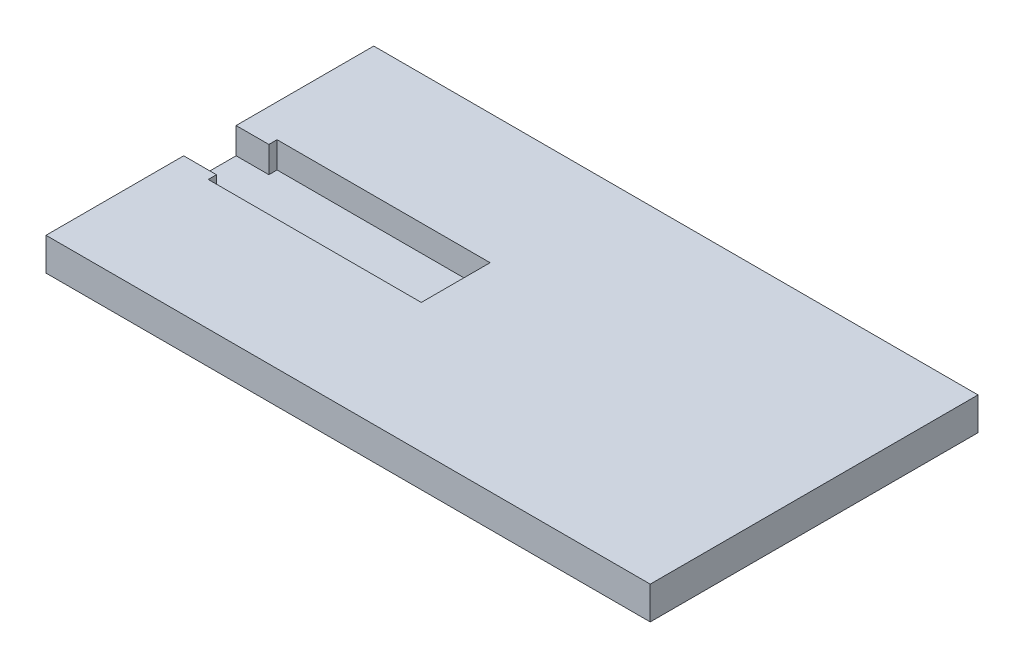
ISO-10303-21;
HEADER;
FILE_DESCRIPTION(('STEP AP214'),'2;1');
FILE_NAME('part.step','',(''),(''),'','','');
FILE_SCHEMA(('AUTOMOTIVE_DESIGN { 1 0 10303 214 1 1 1 1 }'));
ENDSEC;
DATA;
#1=APPLICATION_CONTEXT('core data for automotive mechanical design processes');
#2=APPLICATION_PROTOCOL_DEFINITION('international standard','automotive_design',2000,#1);
#3=PRODUCT_CONTEXT('',#1,'mechanical');
#4=PRODUCT('Part','Part','',(#3));
#5=PRODUCT_RELATED_PRODUCT_CATEGORY('part','',(#4));
#6=PRODUCT_DEFINITION_FORMATION('','',#4);
#7=PRODUCT_DEFINITION_CONTEXT('part definition',#1,'design');
#8=PRODUCT_DEFINITION('design','',#6,#7);
#9=PRODUCT_DEFINITION_SHAPE('','',#8);
#10=(LENGTH_UNIT() NAMED_UNIT(*) SI_UNIT(.MILLI.,.METRE.));
#11=(NAMED_UNIT(*) PLANE_ANGLE_UNIT() SI_UNIT($,.RADIAN.));
#12=(NAMED_UNIT(*) SI_UNIT($,.STERADIAN.) SOLID_ANGLE_UNIT());
#13=UNCERTAINTY_MEASURE_WITH_UNIT(LENGTH_MEASURE(1.E-05),#10,'distance_accuracy_value','');
#14=(GEOMETRIC_REPRESENTATION_CONTEXT(3) GLOBAL_UNCERTAINTY_ASSIGNED_CONTEXT((#13)) GLOBAL_UNIT_ASSIGNED_CONTEXT((#10,
#11,#12)) REPRESENTATION_CONTEXT('',''));
#15=CARTESIAN_POINT('',(0.,0.,0.));
#16=DIRECTION('',(0.,0.,1.));
#17=DIRECTION('',(1.,0.,0.));
#18=AXIS2_PLACEMENT_3D('',#15,#16,#17);
#19=CARTESIAN_POINT('',(46.09,5.,25.));
#20=DIRECTION('',(-1.,0.,0.));
#21=DIRECTION('',(0.,0.,1.));
#22=AXIS2_PLACEMENT_3D('',#19,#20,#21);
#23=PLANE('',#22);
#24=DIRECTION('',(0.,0.,-1.));
#25=VECTOR('',#24,1.);
#26=CARTESIAN_POINT('',(46.09,0.,25.));
#27=LINE('',#26,#25);
#28=CARTESIAN_POINT('',(46.09,0.,25.));
#29=VERTEX_POINT('',#28);
#30=CARTESIAN_POINT('',(46.09,0.,-25.));
#31=VERTEX_POINT('',#30);
#32=EDGE_CURVE('E185',#29,#31,#27,.T.);
#33=ORIENTED_EDGE('',*,*,#32,.T.);
#34=DIRECTION('',(0.,-1.,0.));
#35=VECTOR('',#34,1.);
#36=CARTESIAN_POINT('',(46.09,5.,-25.));
#37=LINE('',#36,#35);
#38=CARTESIAN_POINT('',(46.09,5.,-25.));
#39=VERTEX_POINT('',#38);
#40=EDGE_CURVE('E11',#39,#31,#37,.T.);
#41=ORIENTED_EDGE('',*,*,#40,.F.);
#42=DIRECTION('',(0.,0.,-1.));
#43=VECTOR('',#42,1.);
#44=CARTESIAN_POINT('',(46.09,5.,25.));
#45=LINE('',#44,#43);
#46=CARTESIAN_POINT('',(46.09,5.,25.));
#47=VERTEX_POINT('',#46);
#48=EDGE_CURVE('E198',#47,#39,#45,.T.);
#49=ORIENTED_EDGE('',*,*,#48,.F.);
#50=DIRECTION('',(0.,-1.,0.));
#51=VECTOR('',#50,1.);
#52=CARTESIAN_POINT('',(46.09,5.,25.));
#53=LINE('',#52,#51);
#54=EDGE_CURVE('E206',#47,#29,#53,.T.);
#55=ORIENTED_EDGE('',*,*,#54,.T.);
#56=EDGE_LOOP('',(#33,#41,#49,#55));
#57=FACE_BOUND('',#56,.T.);
#58=ADVANCED_FACE('F33',(#57),#23,.F.);
#59=CARTESIAN_POINT('',(-46.09,5.,-25.));
#60=DIRECTION('',(0.,0.,1.));
#61=DIRECTION('',(1.,0.,0.));
#62=AXIS2_PLACEMENT_3D('',#59,#60,#61);
#63=PLANE('',#62);
#64=DIRECTION('',(-1.,0.,0.));
#65=VECTOR('',#64,1.);
#66=CARTESIAN_POINT('',(-46.09,0.,-25.));
#67=LINE('',#66,#65);
#68=CARTESIAN_POINT('',(-46.09,0.,-25.));
#69=VERTEX_POINT('',#68);
#70=EDGE_CURVE('E209',#31,#69,#67,.T.);
#71=ORIENTED_EDGE('',*,*,#70,.T.);
#72=DIRECTION('',(0.,-1.,0.));
#73=VECTOR('',#72,1.);
#74=CARTESIAN_POINT('',(-46.09,5.,-25.));
#75=LINE('',#74,#73);
#76=CARTESIAN_POINT('',(-46.09,5.,-25.));
#77=VERTEX_POINT('',#76);
#78=EDGE_CURVE('E40',#77,#69,#75,.T.);
#79=ORIENTED_EDGE('',*,*,#78,.F.);
#80=DIRECTION('',(-1.,0.,0.));
#81=VECTOR('',#80,1.);
#82=CARTESIAN_POINT('',(-46.09,5.,-25.));
#83=LINE('',#82,#81);
#84=EDGE_CURVE('E84',#39,#77,#83,.T.);
#85=ORIENTED_EDGE('',*,*,#84,.F.);
#86=ORIENTED_EDGE('',*,*,#40,.T.);
#87=EDGE_LOOP('',(#71,#79,#85,#86));
#88=FACE_BOUND('',#87,.T.);
#89=ADVANCED_FACE('F259',(#88),#63,.F.);
#90=CARTESIAN_POINT('',(-46.09,5.,25.));
#91=DIRECTION('',(1.,0.,0.));
#92=DIRECTION('',(0.,0.,-1.));
#93=AXIS2_PLACEMENT_3D('',#90,#91,#92);
#94=PLANE('',#93);
#95=DIRECTION('',(0.,0.,1.));
#96=VECTOR('',#95,1.);
#97=CARTESIAN_POINT('',(-46.09,5.,25.));
#98=LINE('',#97,#96);
#99=CARTESIAN_POINT('',(-46.09,5.,4.));
#100=VERTEX_POINT('',#99);
#101=CARTESIAN_POINT('',(-46.09,5.,25.));
#102=VERTEX_POINT('',#101);
#103=EDGE_CURVE('E201',#100,#102,#98,.T.);
#104=ORIENTED_EDGE('',*,*,#103,.F.);
#105=DIRECTION('',(0.,1.,0.));
#106=VECTOR('',#105,1.);
#107=CARTESIAN_POINT('',(-46.09,1.,4.));
#108=LINE('',#107,#106);
#109=CARTESIAN_POINT('',(-46.09,1.,4.));
#110=VERTEX_POINT('',#109);
#111=EDGE_CURVE('E190',#110,#100,#108,.T.);
#112=ORIENTED_EDGE('',*,*,#111,.F.);
#113=DIRECTION('',(0.,0.,1.));
#114=VECTOR('',#113,1.);
#115=CARTESIAN_POINT('',(-46.09,1.,4.));
#116=LINE('',#115,#114);
#117=CARTESIAN_POINT('',(-46.09,1.,-4.));
#118=VERTEX_POINT('',#117);
#119=EDGE_CURVE('E161',#118,#110,#116,.T.);
#120=ORIENTED_EDGE('',*,*,#119,.F.);
#121=DIRECTION('',(0.,1.,0.));
#122=VECTOR('',#121,1.);
#123=CARTESIAN_POINT('',(-46.09,1.,-4.));
#124=LINE('',#123,#122);
#125=CARTESIAN_POINT('',(-46.09,5.,-4.));
#126=VERTEX_POINT('',#125);
#127=EDGE_CURVE('E192',#118,#126,#124,.T.);
#128=ORIENTED_EDGE('',*,*,#127,.T.);
#129=EDGE_CURVE('E202',#77,#126,#98,.T.);
#130=ORIENTED_EDGE('',*,*,#129,.F.);
#131=ORIENTED_EDGE('',*,*,#78,.T.);
#132=DIRECTION('',(0.,0.,1.));
#133=VECTOR('',#132,1.);
#134=CARTESIAN_POINT('',(-46.09,0.,25.));
#135=LINE('',#134,#133);
#136=CARTESIAN_POINT('',(-46.09,0.,25.));
#137=VERTEX_POINT('',#136);
#138=EDGE_CURVE('E211',#69,#137,#135,.T.);
#139=ORIENTED_EDGE('',*,*,#138,.T.);
#140=DIRECTION('',(0.,-1.,0.));
#141=VECTOR('',#140,1.);
#142=CARTESIAN_POINT('',(-46.09,5.,25.));
#143=LINE('',#142,#141);
#144=EDGE_CURVE('E215',#102,#137,#143,.T.);
#145=ORIENTED_EDGE('',*,*,#144,.F.);
#146=EDGE_LOOP('',(#104,#112,#120,#128,#130,#131,#139,#145));
#147=FACE_BOUND('',#146,.T.);
#148=ADVANCED_FACE('F221',(#147),#94,.F.);
#149=CARTESIAN_POINT('',(-46.09,5.,25.));
#150=DIRECTION('',(0.,0.,-1.));
#151=DIRECTION('',(-1.,0.,0.));
#152=AXIS2_PLACEMENT_3D('',#149,#150,#151);
#153=PLANE('',#152);
#154=DIRECTION('',(1.,0.,0.));
#155=VECTOR('',#154,1.);
#156=CARTESIAN_POINT('',(-46.09,0.,25.));
#157=LINE('',#156,#155);
#158=EDGE_CURVE('E77',#137,#29,#157,.T.);
#159=ORIENTED_EDGE('',*,*,#158,.T.);
#160=ORIENTED_EDGE('',*,*,#54,.F.);
#161=DIRECTION('',(1.,0.,0.));
#162=VECTOR('',#161,1.);
#163=CARTESIAN_POINT('',(-46.09,5.,25.));
#164=LINE('',#163,#162);
#165=EDGE_CURVE('E56',#102,#47,#164,.T.);
#166=ORIENTED_EDGE('',*,*,#165,.F.);
#167=ORIENTED_EDGE('',*,*,#144,.T.);
#168=EDGE_LOOP('',(#159,#160,#166,#167));
#169=FACE_BOUND('',#168,.T.);
#170=ADVANCED_FACE('F229',(#169),#153,.F.);
#171=CARTESIAN_POINT('',(0.,5.,0.));
#172=DIRECTION('',(0.,-1.,0.));
#173=DIRECTION('',(0.,0.,-1.));
#174=AXIS2_PLACEMENT_3D('',#171,#172,#173);
#175=PLANE('',#174);
#176=DIRECTION('',(0.,0.,1.));
#177=VECTOR('',#176,1.);
#178=CARTESIAN_POINT('',(-41.09,5.,4.));
#179=LINE('',#178,#177);
#180=CARTESIAN_POINT('',(-41.09,5.,4.));
#181=VERTEX_POINT('',#180);
#182=CARTESIAN_POINT('',(-41.09,5.,5.25));
#183=VERTEX_POINT('',#182);
#184=EDGE_CURVE('E154',#181,#183,#179,.T.);
#185=ORIENTED_EDGE('',*,*,#184,.F.);
#186=DIRECTION('',(1.,0.,0.));
#187=VECTOR('',#186,1.);
#188=CARTESIAN_POINT('',(-46.09,5.,4.));
#189=LINE('',#188,#187);
#190=EDGE_CURVE('E178',#100,#181,#189,.T.);
#191=ORIENTED_EDGE('',*,*,#190,.F.);
#192=ORIENTED_EDGE('',*,*,#103,.T.);
#193=ORIENTED_EDGE('',*,*,#165,.T.);
#194=ORIENTED_EDGE('',*,*,#48,.T.);
#195=ORIENTED_EDGE('',*,*,#84,.T.);
#196=ORIENTED_EDGE('',*,*,#129,.T.);
#197=DIRECTION('',(-1.,0.,0.));
#198=VECTOR('',#197,1.);
#199=CARTESIAN_POINT('',(-46.09,5.,-4.));
#200=LINE('',#199,#198);
#201=CARTESIAN_POINT('',(-41.09,5.,-4.));
#202=VERTEX_POINT('',#201);
#203=EDGE_CURVE('E176',#202,#126,#200,.T.);
#204=ORIENTED_EDGE('',*,*,#203,.F.);
#205=DIRECTION('',(0.,0.,1.));
#206=VECTOR('',#205,1.);
#207=CARTESIAN_POINT('',(-41.09,5.,-5.25));
#208=LINE('',#207,#206);
#209=CARTESIAN_POINT('',(-41.09,5.,-5.25));
#210=VERTEX_POINT('',#209);
#211=EDGE_CURVE('E173',#210,#202,#208,.T.);
#212=ORIENTED_EDGE('',*,*,#211,.F.);
#213=DIRECTION('',(-1.,0.,0.));
#214=VECTOR('',#213,1.);
#215=CARTESIAN_POINT('',(-41.09,5.,-5.25));
#216=LINE('',#215,#214);
#217=CARTESIAN_POINT('',(-8.58999999999999,5.,-5.25));
#218=VERTEX_POINT('',#217);
#219=EDGE_CURVE('E171',#218,#210,#216,.T.);
#220=ORIENTED_EDGE('',*,*,#219,.F.);
#221=DIRECTION('',(0.,0.,-1.));
#222=VECTOR('',#221,1.);
#223=CARTESIAN_POINT('',(-8.58999999999999,5.,-5.25));
#224=LINE('',#223,#222);
#225=CARTESIAN_POINT('',(-8.58999999999999,5.,5.25));
#226=VERTEX_POINT('',#225);
#227=EDGE_CURVE('E47',#226,#218,#224,.T.);
#228=ORIENTED_EDGE('',*,*,#227,.F.);
#229=DIRECTION('',(1.,0.,0.));
#230=VECTOR('',#229,1.);
#231=CARTESIAN_POINT('',(-41.09,5.,5.25));
#232=LINE('',#231,#230);
#233=EDGE_CURVE('E151',#183,#226,#232,.T.);
#234=ORIENTED_EDGE('',*,*,#233,.F.);
#235=EDGE_LOOP('',(#185,#191,#192,#193,#194,#195,#196,#204,#212,#220,#228,#234));
#236=FACE_BOUND('',#235,.T.);
#237=ADVANCED_FACE('F234',(#236),#175,.F.);
#238=CARTESIAN_POINT('',(0.,0.,0.));
#239=DIRECTION('',(0.,-1.,0.));
#240=DIRECTION('',(0.,0.,-1.));
#241=AXIS2_PLACEMENT_3D('',#238,#239,#240);
#242=PLANE('',#241);
#243=ORIENTED_EDGE('',*,*,#32,.F.);
#244=ORIENTED_EDGE('',*,*,#158,.F.);
#245=ORIENTED_EDGE('',*,*,#138,.F.);
#246=ORIENTED_EDGE('',*,*,#70,.F.);
#247=EDGE_LOOP('',(#243,#244,#245,#246));
#248=FACE_BOUND('',#247,.T.);
#249=ADVANCED_FACE('F225',(#248),#242,.T.);
#250=CARTESIAN_POINT('',(-8.58999999999999,1.,-5.25));
#251=DIRECTION('',(1.,0.,0.));
#252=DIRECTION('',(0.,0.,-1.));
#253=AXIS2_PLACEMENT_3D('',#250,#251,#252);
#254=PLANE('',#253);
#255=ORIENTED_EDGE('',*,*,#227,.T.);
#256=DIRECTION('',(0.,1.,0.));
#257=VECTOR('',#256,1.);
#258=CARTESIAN_POINT('',(-8.58999999999999,1.,-5.25));
#259=LINE('',#258,#257);
#260=CARTESIAN_POINT('',(-8.58999999999999,1.,-5.25));
#261=VERTEX_POINT('',#260);
#262=EDGE_CURVE('E128',#261,#218,#259,.T.);
#263=ORIENTED_EDGE('',*,*,#262,.F.);
#264=DIRECTION('',(0.,0.,-1.));
#265=VECTOR('',#264,1.);
#266=CARTESIAN_POINT('',(-8.58999999999999,1.,-5.25));
#267=LINE('',#266,#265);
#268=CARTESIAN_POINT('',(-8.58999999999999,1.,5.25));
#269=VERTEX_POINT('',#268);
#270=EDGE_CURVE('E132',#269,#261,#267,.T.);
#271=ORIENTED_EDGE('',*,*,#270,.F.);
#272=DIRECTION('',(0.,1.,0.));
#273=VECTOR('',#272,1.);
#274=CARTESIAN_POINT('',(-8.58999999999999,1.,5.25));
#275=LINE('',#274,#273);
#276=EDGE_CURVE('E183',#269,#226,#275,.T.);
#277=ORIENTED_EDGE('',*,*,#276,.T.);
#278=EDGE_LOOP('',(#255,#263,#271,#277));
#279=FACE_BOUND('',#278,.T.);
#280=ADVANCED_FACE('F130',(#279),#254,.F.);
#281=CARTESIAN_POINT('',(-41.09,1.,5.25));
#282=DIRECTION('',(0.,0.,1.));
#283=DIRECTION('',(1.,0.,0.));
#284=AXIS2_PLACEMENT_3D('',#281,#282,#283);
#285=PLANE('',#284);
#286=ORIENTED_EDGE('',*,*,#233,.T.);
#287=ORIENTED_EDGE('',*,*,#276,.F.);
#288=DIRECTION('',(1.,0.,0.));
#289=VECTOR('',#288,1.);
#290=CARTESIAN_POINT('',(-41.09,1.,5.25));
#291=LINE('',#290,#289);
#292=CARTESIAN_POINT('',(-41.09,1.,5.25));
#293=VERTEX_POINT('',#292);
#294=EDGE_CURVE('E138',#293,#269,#291,.T.);
#295=ORIENTED_EDGE('',*,*,#294,.F.);
#296=DIRECTION('',(0.,1.,0.));
#297=VECTOR('',#296,1.);
#298=CARTESIAN_POINT('',(-41.09,1.,5.25));
#299=LINE('',#298,#297);
#300=EDGE_CURVE('E186',#293,#183,#299,.T.);
#301=ORIENTED_EDGE('',*,*,#300,.T.);
#302=EDGE_LOOP('',(#286,#287,#295,#301));
#303=FACE_BOUND('',#302,.T.);
#304=ADVANCED_FACE('F247',(#303),#285,.F.);
#305=CARTESIAN_POINT('',(-41.09,1.,4.));
#306=DIRECTION('',(-1.,0.,0.));
#307=DIRECTION('',(0.,0.,1.));
#308=AXIS2_PLACEMENT_3D('',#305,#306,#307);
#309=PLANE('',#308);
#310=ORIENTED_EDGE('',*,*,#184,.T.);
#311=ORIENTED_EDGE('',*,*,#300,.F.);
#312=DIRECTION('',(0.,0.,1.));
#313=VECTOR('',#312,1.);
#314=CARTESIAN_POINT('',(-41.09,1.,4.));
#315=LINE('',#314,#313);
#316=CARTESIAN_POINT('',(-41.09,1.,4.));
#317=VERTEX_POINT('',#316);
#318=EDGE_CURVE('E167',#317,#293,#315,.T.);
#319=ORIENTED_EDGE('',*,*,#318,.F.);
#320=DIRECTION('',(0.,1.,0.));
#321=VECTOR('',#320,1.);
#322=CARTESIAN_POINT('',(-41.09,1.,4.));
#323=LINE('',#322,#321);
#324=EDGE_CURVE('E188',#317,#181,#323,.T.);
#325=ORIENTED_EDGE('',*,*,#324,.T.);
#326=EDGE_LOOP('',(#310,#311,#319,#325));
#327=FACE_BOUND('',#326,.T.);
#328=ADVANCED_FACE('F249',(#327),#309,.F.);
#329=CARTESIAN_POINT('',(-46.09,1.,4.));
#330=DIRECTION('',(0.,0.,1.));
#331=DIRECTION('',(1.,0.,0.));
#332=AXIS2_PLACEMENT_3D('',#329,#330,#331);
#333=PLANE('',#332);
#334=ORIENTED_EDGE('',*,*,#190,.T.);
#335=ORIENTED_EDGE('',*,*,#324,.F.);
#336=DIRECTION('',(1.,0.,0.));
#337=VECTOR('',#336,1.);
#338=CARTESIAN_POINT('',(-46.09,1.,4.));
#339=LINE('',#338,#337);
#340=EDGE_CURVE('E164',#110,#317,#339,.T.);
#341=ORIENTED_EDGE('',*,*,#340,.F.);
#342=ORIENTED_EDGE('',*,*,#111,.T.);
#343=EDGE_LOOP('',(#334,#335,#341,#342));
#344=FACE_BOUND('',#343,.T.);
#345=ADVANCED_FACE('F237',(#344),#333,.F.);
#346=CARTESIAN_POINT('',(-46.09,1.,-4.));
#347=DIRECTION('',(0.,0.,-1.));
#348=DIRECTION('',(-1.,0.,0.));
#349=AXIS2_PLACEMENT_3D('',#346,#347,#348);
#350=PLANE('',#349);
#351=ORIENTED_EDGE('',*,*,#203,.T.);
#352=ORIENTED_EDGE('',*,*,#127,.F.);
#353=DIRECTION('',(-1.,0.,0.));
#354=VECTOR('',#353,1.);
#355=CARTESIAN_POINT('',(-46.09,1.,-4.));
#356=LINE('',#355,#354);
#357=CARTESIAN_POINT('',(-41.09,1.,-4.));
#358=VERTEX_POINT('',#357);
#359=EDGE_CURVE('E158',#358,#118,#356,.T.);
#360=ORIENTED_EDGE('',*,*,#359,.F.);
#361=DIRECTION('',(0.,1.,0.));
#362=VECTOR('',#361,1.);
#363=CARTESIAN_POINT('',(-41.09,1.,-4.));
#364=LINE('',#363,#362);
#365=EDGE_CURVE('E195',#358,#202,#364,.T.);
#366=ORIENTED_EDGE('',*,*,#365,.T.);
#367=EDGE_LOOP('',(#351,#352,#360,#366));
#368=FACE_BOUND('',#367,.T.);
#369=ADVANCED_FACE('F243',(#368),#350,.F.);
#370=CARTESIAN_POINT('',(-41.09,1.,-5.25));
#371=DIRECTION('',(-1.,0.,0.));
#372=DIRECTION('',(0.,0.,1.));
#373=AXIS2_PLACEMENT_3D('',#370,#371,#372);
#374=PLANE('',#373);
#375=ORIENTED_EDGE('',*,*,#211,.T.);
#376=ORIENTED_EDGE('',*,*,#365,.F.);
#377=DIRECTION('',(0.,0.,1.));
#378=VECTOR('',#377,1.);
#379=CARTESIAN_POINT('',(-41.09,1.,-5.25));
#380=LINE('',#379,#378);
#381=CARTESIAN_POINT('',(-41.09,1.,-5.25));
#382=VERTEX_POINT('',#381);
#383=EDGE_CURVE('E146',#382,#358,#380,.T.);
#384=ORIENTED_EDGE('',*,*,#383,.F.);
#385=DIRECTION('',(0.,1.,0.));
#386=VECTOR('',#385,1.);
#387=CARTESIAN_POINT('',(-41.09,1.,-5.25));
#388=LINE('',#387,#386);
#389=EDGE_CURVE('E137',#382,#210,#388,.T.);
#390=ORIENTED_EDGE('',*,*,#389,.T.);
#391=EDGE_LOOP('',(#375,#376,#384,#390));
#392=FACE_BOUND('',#391,.T.);
#393=ADVANCED_FACE('F245',(#392),#374,.F.);
#394=CARTESIAN_POINT('',(-41.09,1.,-5.25));
#395=DIRECTION('',(0.,0.,-1.));
#396=DIRECTION('',(-1.,0.,0.));
#397=AXIS2_PLACEMENT_3D('',#394,#395,#396);
#398=PLANE('',#397);
#399=ORIENTED_EDGE('',*,*,#219,.T.);
#400=ORIENTED_EDGE('',*,*,#389,.F.);
#401=DIRECTION('',(-1.,0.,0.));
#402=VECTOR('',#401,1.);
#403=CARTESIAN_POINT('',(-41.09,1.,-5.25));
#404=LINE('',#403,#402);
#405=EDGE_CURVE('E141',#261,#382,#404,.T.);
#406=ORIENTED_EDGE('',*,*,#405,.F.);
#407=ORIENTED_EDGE('',*,*,#262,.T.);
#408=EDGE_LOOP('',(#399,#400,#406,#407));
#409=FACE_BOUND('',#408,.T.);
#410=ADVANCED_FACE('F142',(#409),#398,.F.);
#411=CARTESIAN_POINT('',(0.,1.,0.));
#412=DIRECTION('',(0.,1.,0.));
#413=DIRECTION('',(0.,0.,1.));
#414=AXIS2_PLACEMENT_3D('',#411,#412,#413);
#415=PLANE('',#414);
#416=ORIENTED_EDGE('',*,*,#270,.T.);
#417=ORIENTED_EDGE('',*,*,#405,.T.);
#418=ORIENTED_EDGE('',*,*,#383,.T.);
#419=ORIENTED_EDGE('',*,*,#359,.T.);
#420=ORIENTED_EDGE('',*,*,#119,.T.);
#421=ORIENTED_EDGE('',*,*,#340,.T.);
#422=ORIENTED_EDGE('',*,*,#318,.T.);
#423=ORIENTED_EDGE('',*,*,#294,.T.);
#424=EDGE_LOOP('',(#416,#417,#418,#419,#420,#421,#422,#423));
#425=FACE_BOUND('',#424,.T.);
#426=ADVANCED_FACE('F148',(#425),#415,.T.);
#427=CLOSED_SHELL('',(#58,#89,#148,#170,#237,#249,#280,#304,#328,#345,#369,#393,#410,#426));
#428=MANIFOLD_SOLID_BREP('B2',#427);
#429=ADVANCED_BREP_SHAPE_REPRESENTATION('',(#18,#428),#14);
#430=SHAPE_DEFINITION_REPRESENTATION(#9,#429);
ENDSEC;
END-ISO-10303-21;
